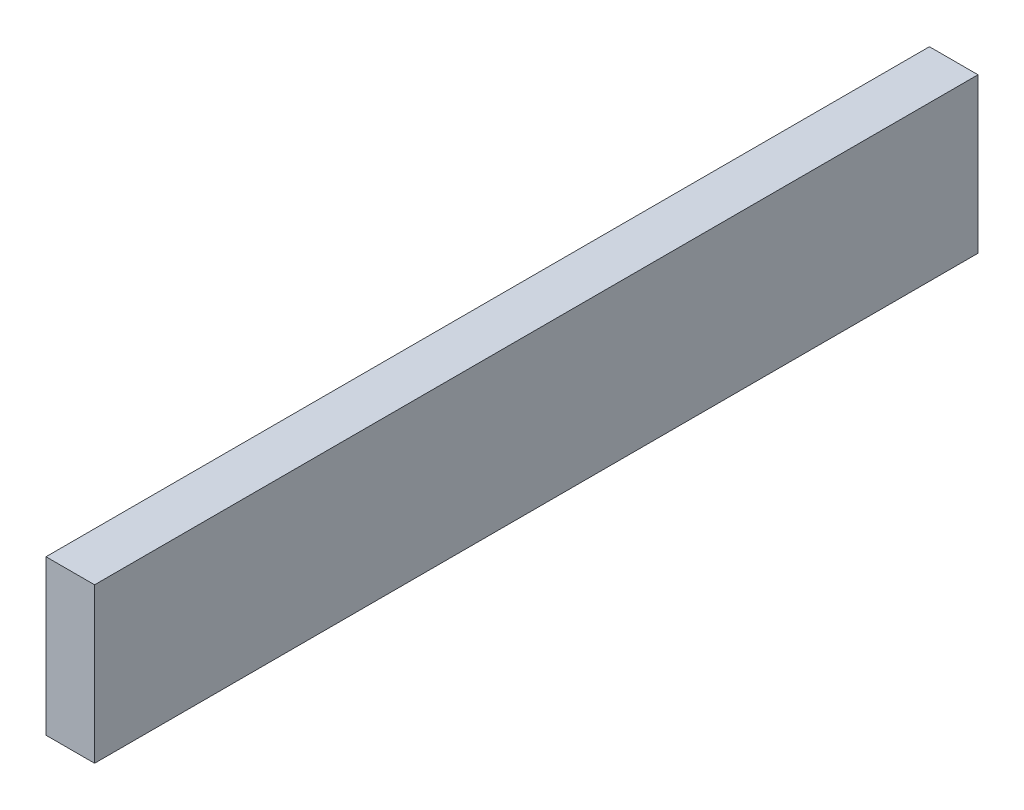
ISO-10303-21;
HEADER;
FILE_DESCRIPTION(('STEP AP214'),'2;1');
FILE_NAME('part.step','',(''),(''),'','','');
FILE_SCHEMA(('AUTOMOTIVE_DESIGN { 1 0 10303 214 1 1 1 1 }'));
ENDSEC;
DATA;
#1=APPLICATION_CONTEXT('core data for automotive mechanical design processes');
#2=APPLICATION_PROTOCOL_DEFINITION('international standard','automotive_design',2000,#1);
#3=PRODUCT_CONTEXT('',#1,'mechanical');
#4=PRODUCT('Part','Part','',(#3));
#5=PRODUCT_RELATED_PRODUCT_CATEGORY('part','',(#4));
#6=PRODUCT_DEFINITION_FORMATION('','',#4);
#7=PRODUCT_DEFINITION_CONTEXT('part definition',#1,'design');
#8=PRODUCT_DEFINITION('design','',#6,#7);
#9=PRODUCT_DEFINITION_SHAPE('','',#8);
#10=(LENGTH_UNIT() NAMED_UNIT(*) SI_UNIT(.MILLI.,.METRE.));
#11=(NAMED_UNIT(*) PLANE_ANGLE_UNIT() SI_UNIT($,.RADIAN.));
#12=(NAMED_UNIT(*) SI_UNIT($,.STERADIAN.) SOLID_ANGLE_UNIT());
#13=UNCERTAINTY_MEASURE_WITH_UNIT(LENGTH_MEASURE(1.E-05),#10,'distance_accuracy_value','');
#14=(GEOMETRIC_REPRESENTATION_CONTEXT(3) GLOBAL_UNCERTAINTY_ASSIGNED_CONTEXT((#13)) GLOBAL_UNIT_ASSIGNED_CONTEXT((#10,
#11,#12)) REPRESENTATION_CONTEXT('',''));
#15=CARTESIAN_POINT('',(0.,0.,0.));
#16=DIRECTION('',(0.,0.,1.));
#17=DIRECTION('',(1.,0.,0.));
#18=AXIS2_PLACEMENT_3D('',#15,#16,#17);
#19=CARTESIAN_POINT('',(0.,70.,0.));
#20=DIRECTION('',(1.,0.,0.));
#21=DIRECTION('',(0.,0.,-1.));
#22=AXIS2_PLACEMENT_3D('',#19,#20,#21);
#23=PLANE('',#22);
#24=DIRECTION('',(0.,0.,1.));
#25=VECTOR('',#24,1.);
#26=CARTESIAN_POINT('',(0.,0.,0.));
#27=LINE('',#26,#25);
#28=CARTESIAN_POINT('',(0.,0.,-400.));
#29=VERTEX_POINT('',#28);
#30=CARTESIAN_POINT('',(0.,0.,0.));
#31=VERTEX_POINT('',#30);
#32=EDGE_CURVE('E94',#29,#31,#27,.T.);
#33=ORIENTED_EDGE('',*,*,#32,.T.);
#34=DIRECTION('',(0.,-1.,0.));
#35=VECTOR('',#34,1.);
#36=CARTESIAN_POINT('',(0.,70.,0.));
#37=LINE('',#36,#35);
#38=CARTESIAN_POINT('',(0.,70.,0.));
#39=VERTEX_POINT('',#38);
#40=EDGE_CURVE('E11',#39,#31,#37,.T.);
#41=ORIENTED_EDGE('',*,*,#40,.F.);
#42=DIRECTION('',(0.,0.,1.));
#43=VECTOR('',#42,1.);
#44=CARTESIAN_POINT('',(0.,70.,0.));
#45=LINE('',#44,#43);
#46=CARTESIAN_POINT('',(0.,70.,-400.));
#47=VERTEX_POINT('',#46);
#48=EDGE_CURVE('E82',#47,#39,#45,.T.);
#49=ORIENTED_EDGE('',*,*,#48,.F.);
#50=DIRECTION('',(0.,-1.,0.));
#51=VECTOR('',#50,1.);
#52=CARTESIAN_POINT('',(0.,70.,-400.));
#53=LINE('',#52,#51);
#54=EDGE_CURVE('E90',#47,#29,#53,.T.);
#55=ORIENTED_EDGE('',*,*,#54,.T.);
#56=EDGE_LOOP('',(#33,#41,#49,#55));
#57=FACE_BOUND('',#56,.T.);
#58=ADVANCED_FACE('F31',(#57),#23,.F.);
#59=CARTESIAN_POINT('',(0.,70.,0.));
#60=DIRECTION('',(0.,0.,-1.));
#61=DIRECTION('',(-1.,0.,0.));
#62=AXIS2_PLACEMENT_3D('',#59,#60,#61);
#63=PLANE('',#62);
#64=DIRECTION('',(1.,0.,0.));
#65=VECTOR('',#64,1.);
#66=CARTESIAN_POINT('',(0.,0.,0.));
#67=LINE('',#66,#65);
#68=CARTESIAN_POINT('',(22.,0.,0.));
#69=VERTEX_POINT('',#68);
#70=EDGE_CURVE('E86',#31,#69,#67,.T.);
#71=ORIENTED_EDGE('',*,*,#70,.T.);
#72=DIRECTION('',(0.,-1.,0.));
#73=VECTOR('',#72,1.);
#74=CARTESIAN_POINT('',(22.,70.,0.));
#75=LINE('',#74,#73);
#76=CARTESIAN_POINT('',(22.,70.,0.));
#77=VERTEX_POINT('',#76);
#78=EDGE_CURVE('E39',#77,#69,#75,.T.);
#79=ORIENTED_EDGE('',*,*,#78,.F.);
#80=DIRECTION('',(1.,0.,0.));
#81=VECTOR('',#80,1.);
#82=CARTESIAN_POINT('',(0.,70.,0.));
#83=LINE('',#82,#81);
#84=EDGE_CURVE('E77',#39,#77,#83,.T.);
#85=ORIENTED_EDGE('',*,*,#84,.F.);
#86=ORIENTED_EDGE('',*,*,#40,.T.);
#87=EDGE_LOOP('',(#71,#79,#85,#86));
#88=FACE_BOUND('',#87,.T.);
#89=ADVANCED_FACE('F85',(#88),#63,.F.);
#90=CARTESIAN_POINT('',(22.,70.,0.));
#91=DIRECTION('',(-1.,0.,0.));
#92=DIRECTION('',(0.,0.,1.));
#93=AXIS2_PLACEMENT_3D('',#90,#91,#92);
#94=PLANE('',#93);
#95=DIRECTION('',(0.,0.,-1.));
#96=VECTOR('',#95,1.);
#97=CARTESIAN_POINT('',(22.,0.,0.));
#98=LINE('',#97,#96);
#99=CARTESIAN_POINT('',(22.,0.,-400.));
#100=VERTEX_POINT('',#99);
#101=EDGE_CURVE('E64',#69,#100,#98,.T.);
#102=ORIENTED_EDGE('',*,*,#101,.T.);
#103=DIRECTION('',(0.,-1.,0.));
#104=VECTOR('',#103,1.);
#105=CARTESIAN_POINT('',(22.,70.,-400.));
#106=LINE('',#105,#104);
#107=CARTESIAN_POINT('',(22.,70.,-400.));
#108=VERTEX_POINT('',#107);
#109=EDGE_CURVE('E87',#108,#100,#106,.T.);
#110=ORIENTED_EDGE('',*,*,#109,.F.);
#111=DIRECTION('',(0.,0.,-1.));
#112=VECTOR('',#111,1.);
#113=CARTESIAN_POINT('',(22.,70.,0.));
#114=LINE('',#113,#112);
#115=EDGE_CURVE('E80',#77,#108,#114,.T.);
#116=ORIENTED_EDGE('',*,*,#115,.F.);
#117=ORIENTED_EDGE('',*,*,#78,.T.);
#118=EDGE_LOOP('',(#102,#110,#116,#117));
#119=FACE_BOUND('',#118,.T.);
#120=ADVANCED_FACE('F88',(#119),#94,.F.);
#121=CARTESIAN_POINT('',(0.,70.,-400.));
#122=DIRECTION('',(0.,0.,1.));
#123=DIRECTION('',(1.,0.,0.));
#124=AXIS2_PLACEMENT_3D('',#121,#122,#123);
#125=PLANE('',#124);
#126=DIRECTION('',(-1.,0.,0.));
#127=VECTOR('',#126,1.);
#128=CARTESIAN_POINT('',(0.,0.,-400.));
#129=LINE('',#128,#127);
#130=EDGE_CURVE('E70',#100,#29,#129,.T.);
#131=ORIENTED_EDGE('',*,*,#130,.T.);
#132=ORIENTED_EDGE('',*,*,#54,.F.);
#133=DIRECTION('',(-1.,0.,0.));
#134=VECTOR('',#133,1.);
#135=CARTESIAN_POINT('',(0.,70.,-400.));
#136=LINE('',#135,#134);
#137=EDGE_CURVE('E47',#108,#47,#136,.T.);
#138=ORIENTED_EDGE('',*,*,#137,.F.);
#139=ORIENTED_EDGE('',*,*,#109,.T.);
#140=EDGE_LOOP('',(#131,#132,#138,#139));
#141=FACE_BOUND('',#140,.T.);
#142=ADVANCED_FACE('F101',(#141),#125,.F.);
#143=CARTESIAN_POINT('',(0.,70.,-400.));
#144=DIRECTION('',(0.,-1.,0.));
#145=DIRECTION('',(0.,0.,-1.));
#146=AXIS2_PLACEMENT_3D('',#143,#144,#145);
#147=PLANE('',#146);
#148=ORIENTED_EDGE('',*,*,#48,.T.);
#149=ORIENTED_EDGE('',*,*,#84,.T.);
#150=ORIENTED_EDGE('',*,*,#115,.T.);
#151=ORIENTED_EDGE('',*,*,#137,.T.);
#152=EDGE_LOOP('',(#148,#149,#150,#151));
#153=FACE_BOUND('',#152,.T.);
#154=ADVANCED_FACE('F78',(#153),#147,.F.);
#155=CARTESIAN_POINT('',(0.,0.,-400.));
#156=DIRECTION('',(0.,-1.,0.));
#157=DIRECTION('',(0.,0.,-1.));
#158=AXIS2_PLACEMENT_3D('',#155,#156,#157);
#159=PLANE('',#158);
#160=ORIENTED_EDGE('',*,*,#32,.F.);
#161=ORIENTED_EDGE('',*,*,#130,.F.);
#162=ORIENTED_EDGE('',*,*,#101,.F.);
#163=ORIENTED_EDGE('',*,*,#70,.F.);
#164=EDGE_LOOP('',(#160,#161,#162,#163));
#165=FACE_BOUND('',#164,.T.);
#166=ADVANCED_FACE('F104',(#165),#159,.T.);
#167=CLOSED_SHELL('',(#58,#89,#120,#142,#154,#166));
#168=MANIFOLD_SOLID_BREP('B2',#167);
#169=ADVANCED_BREP_SHAPE_REPRESENTATION('',(#18,#168),#14);
#170=SHAPE_DEFINITION_REPRESENTATION(#9,#169);
ENDSEC;
END-ISO-10303-21;
